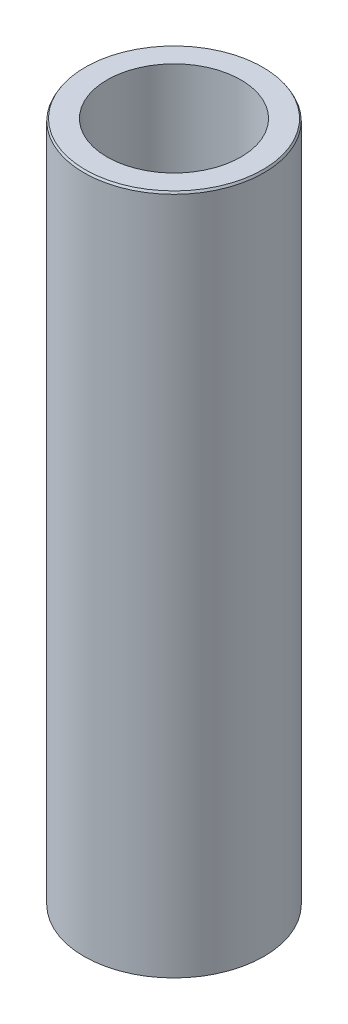
ISO-10303-21;
HEADER;
FILE_DESCRIPTION(('STEP AP214'),'2;1');
FILE_NAME('part.step','',(''),(''),'','','');
FILE_SCHEMA(('AUTOMOTIVE_DESIGN { 1 0 10303 214 1 1 1 1 }'));
ENDSEC;
DATA;
#1=APPLICATION_CONTEXT('core data for automotive mechanical design processes');
#2=APPLICATION_PROTOCOL_DEFINITION('international standard','automotive_design',2000,#1);
#3=PRODUCT_CONTEXT('',#1,'mechanical');
#4=PRODUCT('Part','Part','',(#3));
#5=PRODUCT_RELATED_PRODUCT_CATEGORY('part','',(#4));
#6=PRODUCT_DEFINITION_FORMATION('','',#4);
#7=PRODUCT_DEFINITION_CONTEXT('part definition',#1,'design');
#8=PRODUCT_DEFINITION('design','',#6,#7);
#9=PRODUCT_DEFINITION_SHAPE('','',#8);
#10=(LENGTH_UNIT() NAMED_UNIT(*) SI_UNIT(.MILLI.,.METRE.));
#11=(NAMED_UNIT(*) PLANE_ANGLE_UNIT() SI_UNIT($,.RADIAN.));
#12=(NAMED_UNIT(*) SI_UNIT($,.STERADIAN.) SOLID_ANGLE_UNIT());
#13=UNCERTAINTY_MEASURE_WITH_UNIT(LENGTH_MEASURE(1.E-05),#10,'distance_accuracy_value','');
#14=(GEOMETRIC_REPRESENTATION_CONTEXT(3) GLOBAL_UNCERTAINTY_ASSIGNED_CONTEXT((#13)) GLOBAL_UNIT_ASSIGNED_CONTEXT((#10,
#11,#12)) REPRESENTATION_CONTEXT('',''));
#15=CARTESIAN_POINT('',(0.,0.,0.));
#16=DIRECTION('',(0.,0.,1.));
#17=DIRECTION('',(1.,0.,0.));
#18=AXIS2_PLACEMENT_3D('',#15,#16,#17);
#19=CARTESIAN_POINT('',(0.,284.130501415255,0.));
#20=DIRECTION('',(0.,-1.,0.));
#21=DIRECTION('',(0.,0.,-1.));
#22=AXIS2_PLACEMENT_3D('',#19,#20,#21);
#23=CYLINDRICAL_SURFACE('',#22,37.5);
#24=CARTESIAN_POINT('',(0.,283.259499616688,0.));
#25=DIRECTION('',(0.,1.,0.));
#26=DIRECTION('',(0.,0.,1.));
#27=AXIS2_PLACEMENT_3D('',#24,#25,#26);
#28=CIRCLE('',#27,37.5);
#29=CARTESIAN_POINT('',(0.,283.259499616688,37.5));
#30=VERTEX_POINT('',#29);
#31=EDGE_CURVE('E50',#30,#30,#28,.F.);
#32=ORIENTED_EDGE('',*,*,#31,.T.);
#33=EDGE_LOOP('',(#32));
#34=FACE_BOUND('',#33,.T.);
#35=CARTESIAN_POINT('',(0.,0.502873122867675,0.));
#36=DIRECTION('',(0.,1.,0.));
#37=DIRECTION('',(0.,0.,1.));
#38=AXIS2_PLACEMENT_3D('',#35,#36,#37);
#39=CIRCLE('',#38,37.5);
#40=CARTESIAN_POINT('',(0.,0.502873122867675,37.5));
#41=VERTEX_POINT('',#40);
#42=EDGE_CURVE('E51',#41,#41,#39,.T.);
#43=ORIENTED_EDGE('',*,*,#42,.T.);
#44=EDGE_LOOP('',(#43));
#45=FACE_BOUND('',#44,.T.);
#46=ADVANCED_FACE('F39',(#34,#45),#23,.T.);
#47=CARTESIAN_POINT('',(0.,284.130501415255,0.));
#48=DIRECTION('',(0.,1.,0.));
#49=DIRECTION('',(0.,0.,1.));
#50=AXIS2_PLACEMENT_3D('',#47,#48,#49);
#51=PLANE('',#50);
#52=CARTESIAN_POINT('',(0.,284.130501415255,0.));
#53=DIRECTION('',(0.,1.,0.));
#54=DIRECTION('',(0.,0.,1.));
#55=AXIS2_PLACEMENT_3D('',#52,#53,#54);
#56=CIRCLE('',#55,36.9971268771323);
#57=CARTESIAN_POINT('',(0.,284.130501415255,36.9971268771323));
#58=VERTEX_POINT('',#57);
#59=EDGE_CURVE('E54',#58,#58,#56,.T.);
#60=ORIENTED_EDGE('',*,*,#59,.T.);
#61=EDGE_LOOP('',(#60));
#62=FACE_BOUND('',#61,.T.);
#63=CARTESIAN_POINT('',(0.,284.130501415255,0.));
#64=DIRECTION('',(0.,1.,0.));
#65=DIRECTION('',(0.,0.,1.));
#66=AXIS2_PLACEMENT_3D('',#63,#64,#65);
#67=CIRCLE('',#66,27.8699313653315);
#68=CARTESIAN_POINT('',(0.,284.130501415255,27.8699313653315));
#69=VERTEX_POINT('',#68);
#70=EDGE_CURVE('E58',#69,#69,#67,.T.);
#71=ORIENTED_EDGE('',*,*,#70,.F.);
#72=EDGE_LOOP('',(#71));
#73=FACE_BOUND('',#72,.T.);
#74=ADVANCED_FACE('F69',(#62,#73),#51,.T.);
#75=CARTESIAN_POINT('',(0.,0.,0.));
#76=DIRECTION('',(0.,1.,0.));
#77=DIRECTION('',(0.,0.,1.));
#78=AXIS2_PLACEMENT_3D('',#75,#76,#77);
#79=PLANE('',#78);
#80=CARTESIAN_POINT('',(0.,0.,0.));
#81=DIRECTION('',(0.,1.,0.));
#82=DIRECTION('',(0.,0.,1.));
#83=AXIS2_PLACEMENT_3D('',#80,#81,#82);
#84=CIRCLE('',#83,36.6289982014323);
#85=CARTESIAN_POINT('',(0.,0.,36.6289982014323));
#86=VERTEX_POINT('',#85);
#87=EDGE_CURVE('E10',#86,#86,#84,.F.);
#88=ORIENTED_EDGE('',*,*,#87,.T.);
#89=EDGE_LOOP('',(#88));
#90=FACE_BOUND('',#89,.T.);
#91=CARTESIAN_POINT('',(0.,0.,0.));
#92=DIRECTION('',(0.,1.,0.));
#93=DIRECTION('',(0.,0.,1.));
#94=AXIS2_PLACEMENT_3D('',#91,#92,#93);
#95=CIRCLE('',#94,27.8699313653315);
#96=CARTESIAN_POINT('',(0.,0.,27.8699313653315));
#97=VERTEX_POINT('',#96);
#98=EDGE_CURVE('E63',#97,#97,#95,.T.);
#99=ORIENTED_EDGE('',*,*,#98,.T.);
#100=EDGE_LOOP('',(#99));
#101=FACE_BOUND('',#100,.T.);
#102=ADVANCED_FACE('F75',(#90,#101),#79,.F.);
#103=CARTESIAN_POINT('',(0.,284.130501415255,0.));
#104=DIRECTION('',(0.,-1.,0.));
#105=DIRECTION('',(0.,0.,-1.));
#106=AXIS2_PLACEMENT_3D('',#103,#104,#105);
#107=CYLINDRICAL_SURFACE('',#106,27.8699313653315);
#108=ORIENTED_EDGE('',*,*,#70,.T.);
#109=EDGE_LOOP('',(#108));
#110=FACE_BOUND('',#109,.T.);
#111=ORIENTED_EDGE('',*,*,#98,.F.);
#112=EDGE_LOOP('',(#111));
#113=FACE_BOUND('',#112,.T.);
#114=ADVANCED_FACE('F70',(#110,#113),#107,.F.);
#115=CARTESIAN_POINT('',(0.,284.130501415255,0.));
#116=DIRECTION('',(0.,-1.,0.));
#117=DIRECTION('',(0.,0.,-1.));
#118=AXIS2_PLACEMENT_3D('',#115,#116,#117);
#119=CONICAL_SURFACE('',#118,36.9971268771323,0.523598775598296);
#120=ORIENTED_EDGE('',*,*,#31,.F.);
#121=EDGE_LOOP('',(#120));
#122=FACE_BOUND('',#121,.T.);
#123=ORIENTED_EDGE('',*,*,#59,.F.);
#124=EDGE_LOOP('',(#123));
#125=FACE_BOUND('',#124,.T.);
#126=ADVANCED_FACE('F81',(#122,#125),#119,.T.);
#127=CARTESIAN_POINT('',(0.,0.502873122867675,0.));
#128=DIRECTION('',(0.,1.,0.));
#129=DIRECTION('',(0.,0.,1.));
#130=AXIS2_PLACEMENT_3D('',#127,#128,#129);
#131=CONICAL_SURFACE('',#130,37.5,1.04719755119661);
#132=ORIENTED_EDGE('',*,*,#87,.F.);
#133=EDGE_LOOP('',(#132));
#134=FACE_BOUND('',#133,.T.);
#135=ORIENTED_EDGE('',*,*,#42,.F.);
#136=EDGE_LOOP('',(#135));
#137=FACE_BOUND('',#136,.T.);
#138=ADVANCED_FACE('F45',(#134,#137),#131,.T.);
#139=CLOSED_SHELL('',(#46,#74,#102,#114,#126,#138));
#140=MANIFOLD_SOLID_BREP('B2',#139);
#141=ADVANCED_BREP_SHAPE_REPRESENTATION('',(#18,#140),#14);
#142=SHAPE_DEFINITION_REPRESENTATION(#9,#141);
ENDSEC;
END-ISO-10303-21;
